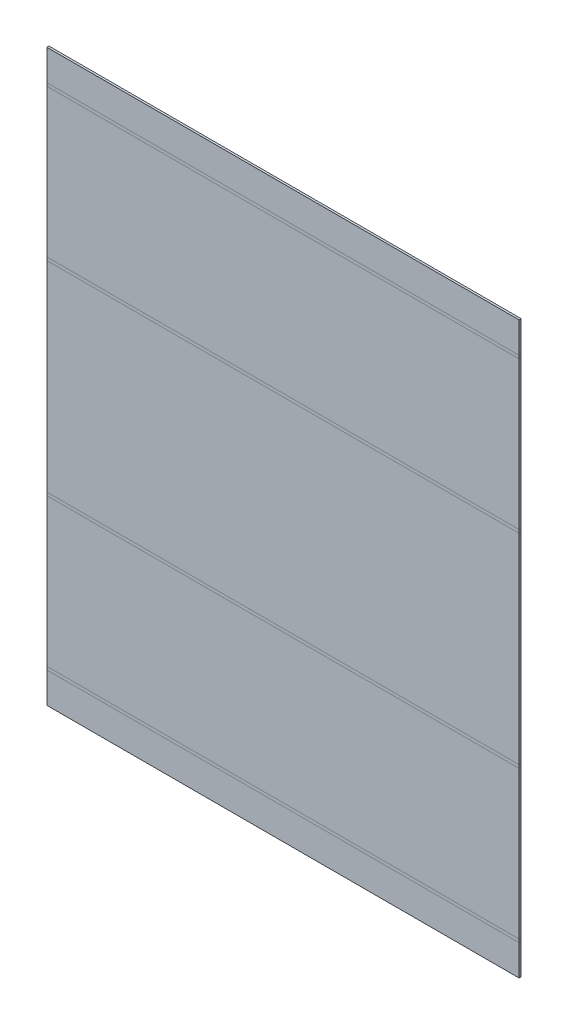
ISO-10303-21;
HEADER;
FILE_DESCRIPTION(('STEP AP214'),'2;1');
FILE_NAME('part.step','',(''),(''),'','','');
FILE_SCHEMA(('AUTOMOTIVE_DESIGN { 1 0 10303 214 1 1 1 1 }'));
ENDSEC;
DATA;
#1=APPLICATION_CONTEXT('core data for automotive mechanical design processes');
#2=APPLICATION_PROTOCOL_DEFINITION('international standard','automotive_design',2000,#1);
#3=PRODUCT_CONTEXT('',#1,'mechanical');
#4=PRODUCT('Part','Part','',(#3));
#5=PRODUCT_RELATED_PRODUCT_CATEGORY('part','',(#4));
#6=PRODUCT_DEFINITION_FORMATION('','',#4);
#7=PRODUCT_DEFINITION_CONTEXT('part definition',#1,'design');
#8=PRODUCT_DEFINITION('design','',#6,#7);
#9=PRODUCT_DEFINITION_SHAPE('','',#8);
#10=(LENGTH_UNIT() NAMED_UNIT(*) SI_UNIT(.MILLI.,.METRE.));
#11=(NAMED_UNIT(*) PLANE_ANGLE_UNIT() SI_UNIT($,.RADIAN.));
#12=(NAMED_UNIT(*) SI_UNIT($,.STERADIAN.) SOLID_ANGLE_UNIT());
#13=UNCERTAINTY_MEASURE_WITH_UNIT(LENGTH_MEASURE(1.E-05),#10,'distance_accuracy_value','');
#14=(GEOMETRIC_REPRESENTATION_CONTEXT(3) GLOBAL_UNCERTAINTY_ASSIGNED_CONTEXT((#13)) GLOBAL_UNIT_ASSIGNED_CONTEXT((#10,
#11,#12)) REPRESENTATION_CONTEXT('',''));
#15=CARTESIAN_POINT('',(0.,0.,0.));
#16=DIRECTION('',(0.,0.,1.));
#17=DIRECTION('',(1.,0.,0.));
#18=AXIS2_PLACEMENT_3D('',#15,#16,#17);
#19=CARTESIAN_POINT('',(355.6,0.,-1.5875));
#20=DIRECTION('',(0.,0.,1.));
#21=DIRECTION('',(1.,0.,0.));
#22=AXIS2_PLACEMENT_3D('',#19,#20,#21);
#23=PLANE('',#22);
#24=DIRECTION('',(-1.,0.,0.));
#25=VECTOR('',#24,1.);
#26=CARTESIAN_POINT('',(355.6,0.736599999999969,-1.58749999999999));
#27=LINE('',#26,#25);
#28=CARTESIAN_POINT('',(355.6,0.736599999999969,-1.58749999999999));
#29=VERTEX_POINT('',#28);
#30=CARTESIAN_POINT('',(0.,0.736599999999971,-1.58749999999999));
#31=VERTEX_POINT('',#30);
#32=EDGE_CURVE('E356',#29,#31,#27,.T.);
#33=ORIENTED_EDGE('',*,*,#32,.T.);
#34=DIRECTION('',(0.,1.,0.));
#35=VECTOR('',#34,1.);
#36=CARTESIAN_POINT('',(0.,0.,-1.5875));
#37=LINE('',#36,#35);
#38=CARTESIAN_POINT('',(0.,151.6634,-1.5875));
#39=VERTEX_POINT('',#38);
#40=EDGE_CURVE('E337',#31,#39,#37,.T.);
#41=ORIENTED_EDGE('',*,*,#40,.T.);
#42=DIRECTION('',(1.,0.,0.));
#43=VECTOR('',#42,1.);
#44=CARTESIAN_POINT('',(0.,151.6634,-1.5875));
#45=LINE('',#44,#43);
#46=CARTESIAN_POINT('',(355.6,151.6634,-1.5875));
#47=VERTEX_POINT('',#46);
#48=EDGE_CURVE('E48',#39,#47,#45,.T.);
#49=ORIENTED_EDGE('',*,*,#48,.T.);
#50=DIRECTION('',(0.,1.,0.));
#51=VECTOR('',#50,1.);
#52=CARTESIAN_POINT('',(355.6,0.,-1.5875));
#53=LINE('',#52,#51);
#54=EDGE_CURVE('E341',#29,#47,#53,.T.);
#55=ORIENTED_EDGE('',*,*,#54,.F.);
#56=EDGE_LOOP('',(#33,#41,#49,#55));
#57=FACE_BOUND('',#56,.T.);
#58=ADVANCED_FACE('F41',(#57),#23,.F.);
#59=CARTESIAN_POINT('',(355.6,0.,0.));
#60=DIRECTION('',(0.,0.,1.));
#61=DIRECTION('',(1.,0.,0.));
#62=AXIS2_PLACEMENT_3D('',#59,#60,#61);
#63=PLANE('',#62);
#64=DIRECTION('',(0.,1.,0.));
#65=VECTOR('',#64,1.);
#66=CARTESIAN_POINT('',(0.,0.,0.));
#67=LINE('',#66,#65);
#68=CARTESIAN_POINT('',(0.,0.736599999999971,0.));
#69=VERTEX_POINT('',#68);
#70=CARTESIAN_POINT('',(0.,151.6634,0.));
#71=VERTEX_POINT('',#70);
#72=EDGE_CURVE('E345',#69,#71,#67,.T.);
#73=ORIENTED_EDGE('',*,*,#72,.F.);
#74=DIRECTION('',(-1.,0.,0.));
#75=VECTOR('',#74,1.);
#76=CARTESIAN_POINT('',(355.6,0.736599999999997,0.));
#77=LINE('',#76,#75);
#78=CARTESIAN_POINT('',(355.6,0.736599999999997,0.));
#79=VERTEX_POINT('',#78);
#80=EDGE_CURVE('E348',#79,#69,#77,.T.);
#81=ORIENTED_EDGE('',*,*,#80,.F.);
#82=DIRECTION('',(0.,1.,0.));
#83=VECTOR('',#82,1.);
#84=CARTESIAN_POINT('',(355.6,0.,0.));
#85=LINE('',#84,#83);
#86=CARTESIAN_POINT('',(355.6,151.6634,0.));
#87=VERTEX_POINT('',#86);
#88=EDGE_CURVE('E344',#79,#87,#85,.T.);
#89=ORIENTED_EDGE('',*,*,#88,.T.);
#90=DIRECTION('',(1.,0.,0.));
#91=VECTOR('',#90,1.);
#92=CARTESIAN_POINT('',(0.,151.6634,0.));
#93=LINE('',#92,#91);
#94=EDGE_CURVE('E374',#71,#87,#93,.T.);
#95=ORIENTED_EDGE('',*,*,#94,.F.);
#96=EDGE_LOOP('',(#73,#81,#89,#95));
#97=FACE_BOUND('',#96,.T.);
#98=ADVANCED_FACE('F403',(#97),#63,.T.);
#99=CARTESIAN_POINT('',(355.6,0.,0.));
#100=DIRECTION('',(-1.,0.,0.));
#101=DIRECTION('',(0.,0.,1.));
#102=AXIS2_PLACEMENT_3D('',#99,#100,#101);
#103=PLANE('',#102);
#104=DIRECTION('',(0.,0.,-1.));
#105=VECTOR('',#104,1.);
#106=CARTESIAN_POINT('',(355.6,0.736599999999997,0.));
#107=LINE('',#106,#105);
#108=EDGE_CURVE('E359',#79,#29,#107,.T.);
#109=ORIENTED_EDGE('',*,*,#108,.T.);
#110=ORIENTED_EDGE('',*,*,#54,.T.);
#111=DIRECTION('',(0.,0.,-1.));
#112=VECTOR('',#111,1.);
#113=CARTESIAN_POINT('',(355.6,151.6634,0.));
#114=LINE('',#113,#112);
#115=EDGE_CURVE('E376',#87,#47,#114,.T.);
#116=ORIENTED_EDGE('',*,*,#115,.F.);
#117=ORIENTED_EDGE('',*,*,#88,.F.);
#118=EDGE_LOOP('',(#109,#110,#116,#117));
#119=FACE_BOUND('',#118,.T.);
#120=ADVANCED_FACE('F389',(#119),#103,.F.);
#121=CARTESIAN_POINT('',(0.,0.,0.));
#122=DIRECTION('',(-1.,0.,0.));
#123=DIRECTION('',(0.,0.,1.));
#124=AXIS2_PLACEMENT_3D('',#121,#122,#123);
#125=PLANE('',#124);
#126=DIRECTION('',(0.,0.,-1.));
#127=VECTOR('',#126,1.);
#128=CARTESIAN_POINT('',(0.,0.736599999999971,0.));
#129=LINE('',#128,#127);
#130=EDGE_CURVE('E354',#69,#31,#129,.T.);
#131=ORIENTED_EDGE('',*,*,#130,.F.);
#132=ORIENTED_EDGE('',*,*,#72,.T.);
#133=DIRECTION('',(0.,0.,-1.));
#134=VECTOR('',#133,1.);
#135=CARTESIAN_POINT('',(0.,151.6634,0.));
#136=LINE('',#135,#134);
#137=EDGE_CURVE('E11',#71,#39,#136,.T.);
#138=ORIENTED_EDGE('',*,*,#137,.T.);
#139=ORIENTED_EDGE('',*,*,#40,.F.);
#140=EDGE_LOOP('',(#131,#132,#138,#139));
#141=FACE_BOUND('',#140,.T.);
#142=ADVANCED_FACE('F407',(#141),#125,.T.);
#143=CARTESIAN_POINT('',(0.,0.736599999999971,0.));
#144=DIRECTION('',(-1.,0.,0.));
#145=DIRECTION('',(0.,-1.,0.));
#146=AXIS2_PLACEMENT_3D('',#143,#144,#145);
#147=PLANE('',#146);
#148=ORIENTED_EDGE('',*,*,#130,.T.);
#149=DIRECTION('',(0.,1.,0.));
#150=VECTOR('',#149,1.);
#151=CARTESIAN_POINT('',(0.,-0.465334079355303,-1.58749999999999));
#152=LINE('',#151,#150);
#153=CARTESIAN_POINT('',(0.,-1.66726815871059,-1.5875));
#154=VERTEX_POINT('',#153);
#155=EDGE_CURVE('E313',#31,#154,#152,.F.);
#156=ORIENTED_EDGE('',*,*,#155,.T.);
#157=DIRECTION('',(0.,0.,-1.));
#158=VECTOR('',#157,1.);
#159=CARTESIAN_POINT('',(0.,-1.6672681587106,0.));
#160=LINE('',#159,#158);
#161=CARTESIAN_POINT('',(0.,-1.6672681587106,0.));
#162=VERTEX_POINT('',#161);
#163=EDGE_CURVE('E317',#162,#154,#160,.T.);
#164=ORIENTED_EDGE('',*,*,#163,.F.);
#165=DIRECTION('',(0.,-1.,0.));
#166=VECTOR('',#165,1.);
#167=CARTESIAN_POINT('',(0.,0.736599999999971,0.));
#168=LINE('',#167,#166);
#169=EDGE_CURVE('E330',#69,#162,#168,.T.);
#170=ORIENTED_EDGE('',*,*,#169,.F.);
#171=EDGE_LOOP('',(#148,#156,#164,#170));
#172=FACE_BOUND('',#171,.T.);
#173=ADVANCED_FACE('F410',(#172),#147,.T.);
#174=CARTESIAN_POINT('',(355.6,-1.6672681587106,0.));
#175=DIRECTION('',(1.,0.,0.));
#176=DIRECTION('',(0.,1.,0.));
#177=AXIS2_PLACEMENT_3D('',#174,#175,#176);
#178=PLANE('',#177);
#179=DIRECTION('',(0.,1.,0.));
#180=VECTOR('',#179,1.);
#181=CARTESIAN_POINT('',(355.6,-0.465334079355303,-1.58749999999999));
#182=LINE('',#181,#180);
#183=CARTESIAN_POINT('',(355.6,-1.66726815871057,-1.58750000000003));
#184=VERTEX_POINT('',#183);
#185=EDGE_CURVE('E334',#184,#29,#182,.T.);
#186=ORIENTED_EDGE('',*,*,#185,.T.);
#187=ORIENTED_EDGE('',*,*,#108,.F.);
#188=DIRECTION('',(0.,1.,0.));
#189=VECTOR('',#188,1.);
#190=CARTESIAN_POINT('',(355.6,-1.6672681587106,0.));
#191=LINE('',#190,#189);
#192=CARTESIAN_POINT('',(355.6,-1.6672681587106,0.));
#193=VERTEX_POINT('',#192);
#194=EDGE_CURVE('E333',#193,#79,#191,.T.);
#195=ORIENTED_EDGE('',*,*,#194,.F.);
#196=DIRECTION('',(0.,0.,-1.));
#197=VECTOR('',#196,1.);
#198=CARTESIAN_POINT('',(355.6,-1.66726815871058,0.));
#199=LINE('',#198,#197);
#200=EDGE_CURVE('E325',#193,#184,#199,.T.);
#201=ORIENTED_EDGE('',*,*,#200,.T.);
#202=EDGE_LOOP('',(#186,#187,#195,#201));
#203=FACE_BOUND('',#202,.T.);
#204=ADVANCED_FACE('F393',(#203),#178,.T.);
#205=CARTESIAN_POINT('',(177.8,-0.465334079355303,0.));
#206=DIRECTION('',(0.,0.,1.));
#207=DIRECTION('',(1.,0.,0.));
#208=AXIS2_PLACEMENT_3D('',#205,#206,#207);
#209=PLANE('',#208);
#210=DIRECTION('',(1.,0.,0.));
#211=VECTOR('',#210,1.);
#212=CARTESIAN_POINT('',(0.,-1.6672681587106,0.));
#213=LINE('',#212,#211);
#214=EDGE_CURVE('E306',#162,#193,#213,.T.);
#215=ORIENTED_EDGE('',*,*,#214,.T.);
#216=ORIENTED_EDGE('',*,*,#194,.T.);
#217=ORIENTED_EDGE('',*,*,#80,.T.);
#218=ORIENTED_EDGE('',*,*,#169,.T.);
#219=EDGE_LOOP('',(#215,#216,#217,#218));
#220=FACE_BOUND('',#219,.T.);
#221=ADVANCED_FACE('F398',(#220),#209,.T.);
#222=CARTESIAN_POINT('',(177.8,-0.465334079355303,-1.58749999999999));
#223=DIRECTION('',(0.,0.,1.));
#224=DIRECTION('',(1.,0.,0.));
#225=AXIS2_PLACEMENT_3D('',#222,#223,#224);
#226=PLANE('',#225);
#227=DIRECTION('',(-1.,0.,0.));
#228=VECTOR('',#227,1.);
#229=CARTESIAN_POINT('',(0.,-1.66726815871059,-1.5875));
#230=LINE('',#229,#228);
#231=EDGE_CURVE('E322',#184,#154,#230,.T.);
#232=ORIENTED_EDGE('',*,*,#231,.T.);
#233=ORIENTED_EDGE('',*,*,#155,.F.);
#234=ORIENTED_EDGE('',*,*,#32,.F.);
#235=ORIENTED_EDGE('',*,*,#185,.F.);
#236=EDGE_LOOP('',(#232,#233,#234,#235));
#237=FACE_BOUND('',#236,.T.);
#238=ADVANCED_FACE('F413',(#237),#226,.F.);
#239=CARTESIAN_POINT('',(0.,-0.930668158710607,0.));
#240=DIRECTION('',(0.,0.,1.));
#241=DIRECTION('',(0.,-1.,0.));
#242=AXIS2_PLACEMENT_3D('',#239,#240,#241);
#243=PLANE('',#242);
#244=DIRECTION('',(0.,1.,0.));
#245=VECTOR('',#244,1.);
#246=CARTESIAN_POINT('',(0.,-0.930668158710607,0.));
#247=LINE('',#246,#245);
#248=CARTESIAN_POINT('',(0.,-112.906568158711,-7.80003764797737E-13));
#249=VERTEX_POINT('',#248);
#250=EDGE_CURVE('E320',#249,#162,#247,.T.);
#251=ORIENTED_EDGE('',*,*,#250,.F.);
#252=DIRECTION('',(1.,0.,0.));
#253=VECTOR('',#252,1.);
#254=CARTESIAN_POINT('',(0.,-112.906568158711,-7.80003764797737E-13));
#255=LINE('',#254,#253);
#256=CARTESIAN_POINT('',(355.6,-112.906568158711,-8.06174162064628E-13));
#257=VERTEX_POINT('',#256);
#258=EDGE_CURVE('E362',#249,#257,#255,.T.);
#259=ORIENTED_EDGE('',*,*,#258,.T.);
#260=DIRECTION('',(0.,-1.,0.));
#261=VECTOR('',#260,1.);
#262=CARTESIAN_POINT('',(355.6,-113.643168158711,-8.08063667707448E-13));
#263=LINE('',#262,#261);
#264=EDGE_CURVE('E311',#193,#257,#263,.T.);
#265=ORIENTED_EDGE('',*,*,#264,.F.);
#266=ORIENTED_EDGE('',*,*,#214,.F.);
#267=EDGE_LOOP('',(#251,#259,#265,#266));
#268=FACE_BOUND('',#267,.T.);
#269=ADVANCED_FACE('F419',(#268),#243,.T.);
#270=CARTESIAN_POINT('',(0.,-0.930668158710596,-1.58749999999999));
#271=DIRECTION('',(1.,0.,0.));
#272=DIRECTION('',(0.,1.,0.));
#273=AXIS2_PLACEMENT_3D('',#270,#271,#272);
#274=PLANE('',#273);
#275=DIRECTION('',(0.,0.,1.));
#276=VECTOR('',#275,1.);
#277=CARTESIAN_POINT('',(0.,-112.906568158711,-1.58750000000078));
#278=LINE('',#277,#276);
#279=CARTESIAN_POINT('',(0.,-112.906568158711,-1.58750000000078));
#280=VERTEX_POINT('',#279);
#281=EDGE_CURVE('E365',#280,#249,#278,.T.);
#282=ORIENTED_EDGE('',*,*,#281,.T.);
#283=ORIENTED_EDGE('',*,*,#250,.T.);
#284=ORIENTED_EDGE('',*,*,#163,.T.);
#285=DIRECTION('',(0.,1.,0.));
#286=VECTOR('',#285,1.);
#287=CARTESIAN_POINT('',(0.,-0.930668158710596,-1.58749999999999));
#288=LINE('',#287,#286);
#289=EDGE_CURVE('E315',#280,#154,#288,.T.);
#290=ORIENTED_EDGE('',*,*,#289,.F.);
#291=EDGE_LOOP('',(#282,#283,#284,#290));
#292=FACE_BOUND('',#291,.T.);
#293=ADVANCED_FACE('F487',(#292),#274,.F.);
#294=CARTESIAN_POINT('',(0.,-0.930668158710596,-1.58749999999999));
#295=DIRECTION('',(0.,0.,1.));
#296=DIRECTION('',(0.,-1.,0.));
#297=AXIS2_PLACEMENT_3D('',#294,#295,#296);
#298=PLANE('',#297);
#299=DIRECTION('',(1.,0.,0.));
#300=VECTOR('',#299,1.);
#301=CARTESIAN_POINT('',(0.,-112.906568158711,-1.58750000000078));
#302=LINE('',#301,#300);
#303=CARTESIAN_POINT('',(355.6,-112.906568158711,-1.58750000000081));
#304=VERTEX_POINT('',#303);
#305=EDGE_CURVE('E368',#280,#304,#302,.T.);
#306=ORIENTED_EDGE('',*,*,#305,.F.);
#307=ORIENTED_EDGE('',*,*,#289,.T.);
#308=ORIENTED_EDGE('',*,*,#231,.F.);
#309=DIRECTION('',(0.,-1.,0.));
#310=VECTOR('',#309,1.);
#311=CARTESIAN_POINT('',(355.6,-113.643168158711,-1.58750000000081));
#312=LINE('',#311,#310);
#313=EDGE_CURVE('E63',#184,#304,#312,.T.);
#314=ORIENTED_EDGE('',*,*,#313,.T.);
#315=EDGE_LOOP('',(#306,#307,#308,#314));
#316=FACE_BOUND('',#315,.T.);
#317=ADVANCED_FACE('F414',(#316),#298,.F.);
#318=CARTESIAN_POINT('',(355.6,-113.643168158711,-1.58750000000081));
#319=DIRECTION('',(-1.,0.,0.));
#320=DIRECTION('',(0.,-1.,0.));
#321=AXIS2_PLACEMENT_3D('',#318,#319,#320);
#322=PLANE('',#321);
#323=DIRECTION('',(0.,0.,1.));
#324=VECTOR('',#323,1.);
#325=CARTESIAN_POINT('',(355.6,-112.906568158711,-1.58750000000081));
#326=LINE('',#325,#324);
#327=EDGE_CURVE('E371',#304,#257,#326,.T.);
#328=ORIENTED_EDGE('',*,*,#327,.F.);
#329=ORIENTED_EDGE('',*,*,#313,.F.);
#330=ORIENTED_EDGE('',*,*,#200,.F.);
#331=ORIENTED_EDGE('',*,*,#264,.T.);
#332=EDGE_LOOP('',(#328,#329,#330,#331));
#333=FACE_BOUND('',#332,.T.);
#334=ADVANCED_FACE('F417',(#333),#322,.F.);
#335=CARTESIAN_POINT('',(0.,-115.310436317421,-7.96789886432091E-13));
#336=DIRECTION('',(-1.,0.,0.));
#337=DIRECTION('',(0.,-1.,0.));
#338=AXIS2_PLACEMENT_3D('',#335,#336,#337);
#339=PLANE('',#338);
#340=ORIENTED_EDGE('',*,*,#281,.F.);
#341=DIRECTION('',(0.,-1.,0.));
#342=VECTOR('',#341,1.);
#343=CARTESIAN_POINT('',(0.,-114.108502238066,-1.58750000000079));
#344=LINE('',#343,#342);
#345=CARTESIAN_POINT('',(0.,-115.310436317421,-1.5875000000008));
#346=VERTEX_POINT('',#345);
#347=EDGE_CURVE('E271',#280,#346,#344,.T.);
#348=ORIENTED_EDGE('',*,*,#347,.T.);
#349=DIRECTION('',(0.,0.,1.));
#350=VECTOR('',#349,1.);
#351=CARTESIAN_POINT('',(0.,-115.310436317421,-1.5875000000008));
#352=LINE('',#351,#350);
#353=CARTESIAN_POINT('',(0.,-115.310436317421,-7.91033905045424E-13));
#354=VERTEX_POINT('',#353);
#355=EDGE_CURVE('E291',#346,#354,#352,.T.);
#356=ORIENTED_EDGE('',*,*,#355,.T.);
#357=DIRECTION('',(0.,-1.,0.));
#358=VECTOR('',#357,1.);
#359=CARTESIAN_POINT('',(0.,-115.310436317421,-7.96789886432091E-13));
#360=LINE('',#359,#358);
#361=EDGE_CURVE('E299',#249,#354,#360,.T.);
#362=ORIENTED_EDGE('',*,*,#361,.F.);
#363=EDGE_LOOP('',(#340,#348,#356,#362));
#364=FACE_BOUND('',#363,.T.);
#365=ADVANCED_FACE('F440',(#364),#339,.T.);
#366=CARTESIAN_POINT('',(355.6,-112.906568158711,-8.06174162064628E-13));
#367=DIRECTION('',(1.,0.,0.));
#368=DIRECTION('',(0.,1.,0.));
#369=AXIS2_PLACEMENT_3D('',#366,#367,#368);
#370=PLANE('',#369);
#371=DIRECTION('',(0.,-1.,0.));
#372=VECTOR('',#371,1.);
#373=CARTESIAN_POINT('',(355.6,-114.108502238066,-1.58750000000081));
#374=LINE('',#373,#372);
#375=CARTESIAN_POINT('',(355.6,-115.310436317421,-1.58750000000081));
#376=VERTEX_POINT('',#375);
#377=EDGE_CURVE('E303',#376,#304,#374,.F.);
#378=ORIENTED_EDGE('',*,*,#377,.T.);
#379=ORIENTED_EDGE('',*,*,#327,.T.);
#380=DIRECTION('',(0.,1.,0.));
#381=VECTOR('',#380,1.);
#382=CARTESIAN_POINT('',(355.6,-112.906568158711,-8.06174162064628E-13));
#383=LINE('',#382,#381);
#384=CARTESIAN_POINT('',(355.6,-115.310436317421,-8.22960283698983E-13));
#385=VERTEX_POINT('',#384);
#386=EDGE_CURVE('E302',#385,#257,#383,.T.);
#387=ORIENTED_EDGE('',*,*,#386,.F.);
#388=DIRECTION('',(0.,0.,1.));
#389=VECTOR('',#388,1.);
#390=CARTESIAN_POINT('',(355.6,-115.310436317421,-1.58750000000081));
#391=LINE('',#390,#389);
#392=EDGE_CURVE('E275',#376,#385,#391,.T.);
#393=ORIENTED_EDGE('',*,*,#392,.F.);
#394=EDGE_LOOP('',(#378,#379,#387,#393));
#395=FACE_BOUND('',#394,.T.);
#396=ADVANCED_FACE('F425',(#395),#370,.T.);
#397=CARTESIAN_POINT('',(177.8,-114.108502238066,-8.0148202424836E-13));
#398=DIRECTION('',(0.,0.,1.));
#399=DIRECTION('',(0.,-1.,0.));
#400=AXIS2_PLACEMENT_3D('',#397,#398,#399);
#401=PLANE('',#400);
#402=DIRECTION('',(1.,0.,0.));
#403=VECTOR('',#402,1.);
#404=CARTESIAN_POINT('',(0.,-115.310436317421,-7.91033905045424E-13));
#405=LINE('',#404,#403);
#406=EDGE_CURVE('E265',#354,#385,#405,.T.);
#407=ORIENTED_EDGE('',*,*,#406,.T.);
#408=ORIENTED_EDGE('',*,*,#386,.T.);
#409=ORIENTED_EDGE('',*,*,#258,.F.);
#410=ORIENTED_EDGE('',*,*,#361,.T.);
#411=EDGE_LOOP('',(#407,#408,#409,#410));
#412=FACE_BOUND('',#411,.T.);
#413=ADVANCED_FACE('F428',(#412),#401,.T.);
#414=CARTESIAN_POINT('',(177.8,-114.108502238066,-1.5875000000008));
#415=DIRECTION('',(0.,0.,1.));
#416=DIRECTION('',(0.,-1.,0.));
#417=AXIS2_PLACEMENT_3D('',#414,#415,#416);
#418=PLANE('',#417);
#419=DIRECTION('',(-1.,0.,0.));
#420=VECTOR('',#419,1.);
#421=CARTESIAN_POINT('',(355.6,-115.310436317421,-1.58750000000081));
#422=LINE('',#421,#420);
#423=EDGE_CURVE('E294',#376,#346,#422,.T.);
#424=ORIENTED_EDGE('',*,*,#423,.T.);
#425=ORIENTED_EDGE('',*,*,#347,.F.);
#426=ORIENTED_EDGE('',*,*,#305,.T.);
#427=ORIENTED_EDGE('',*,*,#377,.F.);
#428=EDGE_LOOP('',(#424,#425,#426,#427));
#429=FACE_BOUND('',#428,.T.);
#430=ADVANCED_FACE('F443',(#429),#418,.F.);
#431=CARTESIAN_POINT('',(355.6,-138.386336317421,-8.18789480661053E-13));
#432=DIRECTION('',(0.,1.,0.));
#433=DIRECTION('',(0.,0.,1.));
#434=AXIS2_PLACEMENT_3D('',#431,#432,#433);
#435=PLANE('',#434);
#436=DIRECTION('',(1.,0.,0.));
#437=VECTOR('',#436,1.);
#438=CARTESIAN_POINT('',(355.6,-138.386336317421,-1.58750000000082));
#439=LINE('',#438,#437);
#440=CARTESIAN_POINT('',(0.,-138.386336317421,-1.5875000000008));
#441=VERTEX_POINT('',#440);
#442=CARTESIAN_POINT('',(355.6,-138.386336317421,-1.58750000000082));
#443=VERTEX_POINT('',#442);
#444=EDGE_CURVE('E289',#441,#443,#439,.T.);
#445=ORIENTED_EDGE('',*,*,#444,.T.);
#446=DIRECTION('',(0.,0.,-1.));
#447=VECTOR('',#446,1.);
#448=CARTESIAN_POINT('',(355.6,-138.386336317421,-8.18789480661053E-13));
#449=LINE('',#448,#447);
#450=CARTESIAN_POINT('',(355.6,-138.386336317421,-8.18789480661053E-13));
#451=VERTEX_POINT('',#450);
#452=EDGE_CURVE('E272',#451,#443,#449,.T.);
#453=ORIENTED_EDGE('',*,*,#452,.F.);
#454=DIRECTION('',(1.,0.,0.));
#455=VECTOR('',#454,1.);
#456=CARTESIAN_POINT('',(355.6,-138.386336317421,-8.18789480661053E-13));
#457=LINE('',#456,#455);
#458=CARTESIAN_POINT('',(0.,-138.386336317421,-7.91033905045424E-13));
#459=VERTEX_POINT('',#458);
#460=EDGE_CURVE('E282',#459,#451,#457,.T.);
#461=ORIENTED_EDGE('',*,*,#460,.F.);
#462=DIRECTION('',(0.,0.,-1.));
#463=VECTOR('',#462,1.);
#464=CARTESIAN_POINT('',(0.,-138.386336317421,-7.91033905045424E-13));
#465=LINE('',#464,#463);
#466=EDGE_CURVE('E286',#459,#441,#465,.T.);
#467=ORIENTED_EDGE('',*,*,#466,.T.);
#468=EDGE_LOOP('',(#445,#453,#461,#467));
#469=FACE_BOUND('',#468,.T.);
#470=ADVANCED_FACE('F453',(#469),#435,.F.);
#471=CARTESIAN_POINT('',(0.,-112.986336317421,-7.91033905045424E-13));
#472=DIRECTION('',(0.,0.,-1.));
#473=DIRECTION('',(-1.,0.,0.));
#474=AXIS2_PLACEMENT_3D('',#471,#472,#473);
#475=PLANE('',#474);
#476=ORIENTED_EDGE('',*,*,#406,.F.);
#477=DIRECTION('',(0.,-1.,0.));
#478=VECTOR('',#477,1.);
#479=CARTESIAN_POINT('',(0.,-138.386336317421,-7.91033905045424E-13));
#480=LINE('',#479,#478);
#481=EDGE_CURVE('E284',#354,#459,#480,.T.);
#482=ORIENTED_EDGE('',*,*,#481,.T.);
#483=ORIENTED_EDGE('',*,*,#460,.T.);
#484=DIRECTION('',(0.,1.,0.));
#485=VECTOR('',#484,1.);
#486=CARTESIAN_POINT('',(355.6,-114.573836317421,-8.18789480661053E-13));
#487=LINE('',#486,#485);
#488=EDGE_CURVE('E279',#451,#385,#487,.T.);
#489=ORIENTED_EDGE('',*,*,#488,.T.);
#490=EDGE_LOOP('',(#476,#482,#483,#489));
#491=FACE_BOUND('',#490,.T.);
#492=ADVANCED_FACE('F431',(#491),#475,.F.);
#493=CARTESIAN_POINT('',(0.,-138.386336317421,-7.91033905045424E-13));
#494=DIRECTION('',(1.,0.,0.));
#495=DIRECTION('',(0.,0.,-1.));
#496=AXIS2_PLACEMENT_3D('',#493,#494,#495);
#497=PLANE('',#496);
#498=ORIENTED_EDGE('',*,*,#355,.F.);
#499=DIRECTION('',(0.,-1.,0.));
#500=VECTOR('',#499,1.);
#501=CARTESIAN_POINT('',(0.,-138.386336317421,-1.5875000000008));
#502=LINE('',#501,#500);
#503=EDGE_CURVE('E277',#346,#441,#502,.T.);
#504=ORIENTED_EDGE('',*,*,#503,.T.);
#505=ORIENTED_EDGE('',*,*,#466,.F.);
#506=ORIENTED_EDGE('',*,*,#481,.F.);
#507=EDGE_LOOP('',(#498,#504,#505,#506));
#508=FACE_BOUND('',#507,.T.);
#509=ADVANCED_FACE('F436',(#508),#497,.F.);
#510=CARTESIAN_POINT('',(0.,-112.986336317421,-1.5875000000008));
#511=DIRECTION('',(0.,0.,-1.));
#512=DIRECTION('',(-1.,0.,0.));
#513=AXIS2_PLACEMENT_3D('',#510,#511,#512);
#514=PLANE('',#513);
#515=ORIENTED_EDGE('',*,*,#503,.F.);
#516=ORIENTED_EDGE('',*,*,#423,.F.);
#517=DIRECTION('',(0.,1.,0.));
#518=VECTOR('',#517,1.);
#519=CARTESIAN_POINT('',(355.6,-114.573836317421,-1.58750000000082));
#520=LINE('',#519,#518);
#521=EDGE_CURVE('E269',#443,#376,#520,.T.);
#522=ORIENTED_EDGE('',*,*,#521,.F.);
#523=ORIENTED_EDGE('',*,*,#444,.F.);
#524=EDGE_LOOP('',(#515,#516,#522,#523));
#525=FACE_BOUND('',#524,.T.);
#526=ADVANCED_FACE('F447',(#525),#514,.T.);
#527=CARTESIAN_POINT('',(355.6,-114.573836317421,-8.18789480661053E-13));
#528=DIRECTION('',(-1.,0.,0.));
#529=DIRECTION('',(0.,0.,1.));
#530=AXIS2_PLACEMENT_3D('',#527,#528,#529);
#531=PLANE('',#530);
#532=ORIENTED_EDGE('',*,*,#392,.T.);
#533=ORIENTED_EDGE('',*,*,#488,.F.);
#534=ORIENTED_EDGE('',*,*,#452,.T.);
#535=ORIENTED_EDGE('',*,*,#521,.T.);
#536=EDGE_LOOP('',(#532,#533,#534,#535));
#537=FACE_BOUND('',#536,.T.);
#538=ADVANCED_FACE('F450',(#537),#531,.F.);
#539=CARTESIAN_POINT('',(355.6,151.6634,0.));
#540=DIRECTION('',(1.,0.,0.));
#541=DIRECTION('',(0.,1.,0.));
#542=AXIS2_PLACEMENT_3D('',#539,#540,#541);
#543=PLANE('',#542);
#544=ORIENTED_EDGE('',*,*,#115,.T.);
#545=DIRECTION('',(0.,1.,0.));
#546=VECTOR('',#545,1.);
#547=CARTESIAN_POINT('',(355.6,152.865334079355,-1.5875));
#548=LINE('',#547,#546);
#549=CARTESIAN_POINT('',(355.6,154.067268158711,-1.58749999999999));
#550=VERTEX_POINT('',#549);
#551=EDGE_CURVE('E189',#47,#550,#548,.T.);
#552=ORIENTED_EDGE('',*,*,#551,.T.);
#553=DIRECTION('',(0.,0.,-1.));
#554=VECTOR('',#553,1.);
#555=CARTESIAN_POINT('',(355.6,154.067268158711,0.));
#556=LINE('',#555,#554);
#557=CARTESIAN_POINT('',(355.6,154.067268158711,0.));
#558=VERTEX_POINT('',#557);
#559=EDGE_CURVE('E871',#558,#550,#556,.T.);
#560=ORIENTED_EDGE('',*,*,#559,.F.);
#561=DIRECTION('',(0.,1.,0.));
#562=VECTOR('',#561,1.);
#563=CARTESIAN_POINT('',(355.6,151.6634,0.));
#564=LINE('',#563,#562);
#565=EDGE_CURVE('E259',#87,#558,#564,.T.);
#566=ORIENTED_EDGE('',*,*,#565,.F.);
#567=EDGE_LOOP('',(#544,#552,#560,#566));
#568=FACE_BOUND('',#567,.T.);
#569=ADVANCED_FACE('F501',(#568),#543,.T.);
#570=CARTESIAN_POINT('',(0.,154.067268158711,0.));
#571=DIRECTION('',(-1.,0.,0.));
#572=DIRECTION('',(0.,-1.,0.));
#573=AXIS2_PLACEMENT_3D('',#570,#571,#572);
#574=PLANE('',#573);
#575=DIRECTION('',(0.,1.,0.));
#576=VECTOR('',#575,1.);
#577=CARTESIAN_POINT('',(0.,152.865334079355,-1.5875));
#578=LINE('',#577,#576);
#579=CARTESIAN_POINT('',(0.,154.067268158711,-1.58749999999999));
#580=VERTEX_POINT('',#579);
#581=EDGE_CURVE('E55',#580,#39,#578,.F.);
#582=ORIENTED_EDGE('',*,*,#581,.T.);
#583=ORIENTED_EDGE('',*,*,#137,.F.);
#584=DIRECTION('',(0.,-1.,0.));
#585=VECTOR('',#584,1.);
#586=CARTESIAN_POINT('',(0.,154.067268158711,0.));
#587=LINE('',#586,#585);
#588=CARTESIAN_POINT('',(0.,154.067268158711,0.));
#589=VERTEX_POINT('',#588);
#590=EDGE_CURVE('E262',#589,#71,#587,.T.);
#591=ORIENTED_EDGE('',*,*,#590,.F.);
#592=DIRECTION('',(0.,0.,-1.));
#593=VECTOR('',#592,1.);
#594=CARTESIAN_POINT('',(0.,154.067268158711,0.));
#595=LINE('',#594,#593);
#596=EDGE_CURVE('E185',#589,#580,#595,.T.);
#597=ORIENTED_EDGE('',*,*,#596,.T.);
#598=EDGE_LOOP('',(#582,#583,#591,#597));
#599=FACE_BOUND('',#598,.T.);
#600=ADVANCED_FACE('F525',(#599),#574,.T.);
#601=CARTESIAN_POINT('',(177.8,152.865334079355,0.));
#602=DIRECTION('',(0.,0.,1.));
#603=DIRECTION('',(1.,0.,0.));
#604=AXIS2_PLACEMENT_3D('',#601,#602,#603);
#605=PLANE('',#604);
#606=DIRECTION('',(-1.,0.,0.));
#607=VECTOR('',#606,1.);
#608=CARTESIAN_POINT('',(355.6,154.067268158711,0.));
#609=LINE('',#608,#607);
#610=EDGE_CURVE('E257',#558,#589,#609,.T.);
#611=ORIENTED_EDGE('',*,*,#610,.T.);
#612=ORIENTED_EDGE('',*,*,#590,.T.);
#613=ORIENTED_EDGE('',*,*,#94,.T.);
#614=ORIENTED_EDGE('',*,*,#565,.T.);
#615=EDGE_LOOP('',(#611,#612,#613,#614));
#616=FACE_BOUND('',#615,.T.);
#617=ADVANCED_FACE('F535',(#616),#605,.T.);
#618=CARTESIAN_POINT('',(177.8,152.865334079355,-1.5875));
#619=DIRECTION('',(0.,0.,1.));
#620=DIRECTION('',(1.,0.,0.));
#621=AXIS2_PLACEMENT_3D('',#618,#619,#620);
#622=PLANE('',#621);
#623=DIRECTION('',(1.,0.,0.));
#624=VECTOR('',#623,1.);
#625=CARTESIAN_POINT('',(0.,154.067268158711,-1.58749999999999));
#626=LINE('',#625,#624);
#627=EDGE_CURVE('E253',#580,#550,#626,.T.);
#628=ORIENTED_EDGE('',*,*,#627,.T.);
#629=ORIENTED_EDGE('',*,*,#551,.F.);
#630=ORIENTED_EDGE('',*,*,#48,.F.);
#631=ORIENTED_EDGE('',*,*,#581,.F.);
#632=EDGE_LOOP('',(#628,#629,#630,#631));
#633=FACE_BOUND('',#632,.T.);
#634=ADVANCED_FACE('F383',(#633),#622,.F.);
#635=CARTESIAN_POINT('',(0.,290.786336317421,-7.7715611723761E-13));
#636=DIRECTION('',(0.,-1.,0.));
#637=DIRECTION('',(0.,0.,-1.));
#638=AXIS2_PLACEMENT_3D('',#635,#636,#637);
#639=PLANE('',#638);
#640=DIRECTION('',(-1.,0.,0.));
#641=VECTOR('',#640,1.);
#642=CARTESIAN_POINT('',(0.,290.786336317421,-1.58750000000077));
#643=LINE('',#642,#641);
#644=CARTESIAN_POINT('',(355.6,290.786336317421,-1.58750000000077));
#645=VERTEX_POINT('',#644);
#646=CARTESIAN_POINT('',(0.,290.786336317421,-1.58750000000077));
#647=VERTEX_POINT('',#646);
#648=EDGE_CURVE('E251',#645,#647,#643,.T.);
#649=ORIENTED_EDGE('',*,*,#648,.T.);
#650=DIRECTION('',(0.,0.,-1.));
#651=VECTOR('',#650,1.);
#652=CARTESIAN_POINT('',(0.,290.786336317421,-7.7715611723761E-13));
#653=LINE('',#652,#651);
#654=CARTESIAN_POINT('',(0.,290.786336317421,-7.7715611723761E-13));
#655=VERTEX_POINT('',#654);
#656=EDGE_CURVE('E243',#655,#647,#653,.T.);
#657=ORIENTED_EDGE('',*,*,#656,.F.);
#658=DIRECTION('',(-1.,0.,0.));
#659=VECTOR('',#658,1.);
#660=CARTESIAN_POINT('',(0.,290.786336317421,-7.7715611723761E-13));
#661=LINE('',#660,#659);
#662=CARTESIAN_POINT('',(355.6,290.786336317421,-7.7715611723761E-13));
#663=VERTEX_POINT('',#662);
#664=EDGE_CURVE('E235',#663,#655,#661,.T.);
#665=ORIENTED_EDGE('',*,*,#664,.F.);
#666=DIRECTION('',(0.,0.,-1.));
#667=VECTOR('',#666,1.);
#668=CARTESIAN_POINT('',(355.6,290.786336317421,-7.7715611723761E-13));
#669=LINE('',#668,#667);
#670=EDGE_CURVE('E248',#663,#645,#669,.T.);
#671=ORIENTED_EDGE('',*,*,#670,.T.);
#672=EDGE_LOOP('',(#649,#657,#665,#671));
#673=FACE_BOUND('',#672,.T.);
#674=ADVANCED_FACE('F552',(#673),#639,.F.);
#675=CARTESIAN_POINT('',(0.,266.973836317421,-7.49400541621981E-13));
#676=DIRECTION('',(1.,0.,0.));
#677=DIRECTION('',(0.,0.,-1.));
#678=AXIS2_PLACEMENT_3D('',#675,#676,#677);
#679=PLANE('',#678);
#680=DIRECTION('',(0.,0.,1.));
#681=VECTOR('',#680,1.);
#682=CARTESIAN_POINT('',(0.,267.710436317421,-1.58750000000077));
#683=LINE('',#682,#681);
#684=CARTESIAN_POINT('',(0.,267.710436317421,-1.58750000000077));
#685=VERTEX_POINT('',#684);
#686=CARTESIAN_POINT('',(0.,267.710436317421,-7.7715611723761E-13));
#687=VERTEX_POINT('',#686);
#688=EDGE_CURVE('E246',#685,#687,#683,.T.);
#689=ORIENTED_EDGE('',*,*,#688,.T.);
#690=DIRECTION('',(0.,-1.,0.));
#691=VECTOR('',#690,1.);
#692=CARTESIAN_POINT('',(0.,266.973836317421,-7.49400541621981E-13));
#693=LINE('',#692,#691);
#694=EDGE_CURVE('E232',#655,#687,#693,.T.);
#695=ORIENTED_EDGE('',*,*,#694,.F.);
#696=ORIENTED_EDGE('',*,*,#656,.T.);
#697=DIRECTION('',(0.,-1.,0.));
#698=VECTOR('',#697,1.);
#699=CARTESIAN_POINT('',(0.,266.973836317421,-1.58750000000077));
#700=LINE('',#699,#698);
#701=EDGE_CURVE('E241',#647,#685,#700,.T.);
#702=ORIENTED_EDGE('',*,*,#701,.T.);
#703=EDGE_LOOP('',(#689,#695,#696,#702));
#704=FACE_BOUND('',#703,.T.);
#705=ADVANCED_FACE('F561',(#704),#679,.F.);
#706=CARTESIAN_POINT('',(0.,112.986336317421,-1.5875000000008));
#707=DIRECTION('',(0.,0.,-1.));
#708=DIRECTION('',(-1.,0.,0.));
#709=AXIS2_PLACEMENT_3D('',#706,#707,#708);
#710=PLANE('',#709);
#711=DIRECTION('',(0.,1.,0.));
#712=VECTOR('',#711,1.);
#713=CARTESIAN_POINT('',(355.6,290.786336317421,-1.58750000000077));
#714=LINE('',#713,#712);
#715=CARTESIAN_POINT('',(355.6,267.710436317421,-1.58750000000077));
#716=VERTEX_POINT('',#715);
#717=EDGE_CURVE('E239',#716,#645,#714,.T.);
#718=ORIENTED_EDGE('',*,*,#717,.F.);
#719=DIRECTION('',(1.,0.,0.));
#720=VECTOR('',#719,1.);
#721=CARTESIAN_POINT('',(0.,267.710436317421,-1.58750000000077));
#722=LINE('',#721,#720);
#723=EDGE_CURVE('E212',#685,#716,#722,.T.);
#724=ORIENTED_EDGE('',*,*,#723,.F.);
#725=ORIENTED_EDGE('',*,*,#701,.F.);
#726=ORIENTED_EDGE('',*,*,#648,.F.);
#727=EDGE_LOOP('',(#718,#724,#725,#726));
#728=FACE_BOUND('',#727,.T.);
#729=ADVANCED_FACE('F569',(#728),#710,.T.);
#730=CARTESIAN_POINT('',(355.6,290.786336317421,-7.7715611723761E-13));
#731=DIRECTION('',(-1.,0.,0.));
#732=DIRECTION('',(0.,0.,1.));
#733=AXIS2_PLACEMENT_3D('',#730,#731,#732);
#734=PLANE('',#733);
#735=DIRECTION('',(0.,0.,1.));
#736=VECTOR('',#735,1.);
#737=CARTESIAN_POINT('',(355.6,267.710436317421,-1.58750000000077));
#738=LINE('',#737,#736);
#739=CARTESIAN_POINT('',(355.6,267.710436317421,-7.49400541621981E-13));
#740=VERTEX_POINT('',#739);
#741=EDGE_CURVE('E219',#716,#740,#738,.T.);
#742=ORIENTED_EDGE('',*,*,#741,.F.);
#743=ORIENTED_EDGE('',*,*,#717,.T.);
#744=ORIENTED_EDGE('',*,*,#670,.F.);
#745=DIRECTION('',(0.,1.,0.));
#746=VECTOR('',#745,1.);
#747=CARTESIAN_POINT('',(355.6,290.786336317421,-7.7715611723761E-13));
#748=LINE('',#747,#746);
#749=EDGE_CURVE('E237',#740,#663,#748,.T.);
#750=ORIENTED_EDGE('',*,*,#749,.F.);
#751=EDGE_LOOP('',(#742,#743,#744,#750));
#752=FACE_BOUND('',#751,.T.);
#753=ADVANCED_FACE('F577',(#752),#734,.F.);
#754=CARTESIAN_POINT('',(0.,112.986336317421,-7.7715611723761E-13));
#755=DIRECTION('',(0.,0.,-1.));
#756=DIRECTION('',(-1.,0.,0.));
#757=AXIS2_PLACEMENT_3D('',#754,#755,#756);
#758=PLANE('',#757);
#759=DIRECTION('',(-1.,0.,0.));
#760=VECTOR('',#759,1.);
#761=CARTESIAN_POINT('',(0.,267.710436317421,-7.49400541621981E-13));
#762=LINE('',#761,#760);
#763=EDGE_CURVE('E216',#740,#687,#762,.T.);
#764=ORIENTED_EDGE('',*,*,#763,.F.);
#765=ORIENTED_EDGE('',*,*,#749,.T.);
#766=ORIENTED_EDGE('',*,*,#664,.T.);
#767=ORIENTED_EDGE('',*,*,#694,.T.);
#768=EDGE_LOOP('',(#764,#765,#766,#767));
#769=FACE_BOUND('',#768,.T.);
#770=ADVANCED_FACE('F585',(#769),#758,.F.);
#771=CARTESIAN_POINT('',(0.,265.306568158711,-7.7715611723761E-13));
#772=DIRECTION('',(-1.,0.,0.));
#773=DIRECTION('',(0.,-1.,0.));
#774=AXIS2_PLACEMENT_3D('',#771,#772,#773);
#775=PLANE('',#774);
#776=DIRECTION('',(0.,-1.,0.));
#777=VECTOR('',#776,1.);
#778=CARTESIAN_POINT('',(0.,266.508502238066,-1.58750000000077));
#779=LINE('',#778,#777);
#780=CARTESIAN_POINT('',(0.,265.306568158711,-1.58750000000077));
#781=VERTEX_POINT('',#780);
#782=EDGE_CURVE('E211',#685,#781,#779,.T.);
#783=ORIENTED_EDGE('',*,*,#782,.T.);
#784=DIRECTION('',(0.,0.,1.));
#785=VECTOR('',#784,1.);
#786=CARTESIAN_POINT('',(0.,265.306568158711,-1.58750000000077));
#787=LINE('',#786,#785);
#788=CARTESIAN_POINT('',(0.,265.306568158711,-7.7715611723761E-13));
#789=VERTEX_POINT('',#788);
#790=EDGE_CURVE('E183',#781,#789,#787,.T.);
#791=ORIENTED_EDGE('',*,*,#790,.T.);
#792=DIRECTION('',(0.,-1.,0.));
#793=VECTOR('',#792,1.);
#794=CARTESIAN_POINT('',(0.,265.306568158711,-7.7715611723761E-13));
#795=LINE('',#794,#793);
#796=EDGE_CURVE('E209',#687,#789,#795,.T.);
#797=ORIENTED_EDGE('',*,*,#796,.F.);
#798=ORIENTED_EDGE('',*,*,#688,.F.);
#799=EDGE_LOOP('',(#783,#791,#797,#798));
#800=FACE_BOUND('',#799,.T.);
#801=ADVANCED_FACE('F207',(#800),#775,.T.);
#802=CARTESIAN_POINT('',(177.8,266.508502238066,-1.58750000000077));
#803=DIRECTION('',(0.,0.,1.));
#804=DIRECTION('',(0.,-1.,0.));
#805=AXIS2_PLACEMENT_3D('',#802,#803,#804);
#806=PLANE('',#805);
#807=ORIENTED_EDGE('',*,*,#723,.T.);
#808=DIRECTION('',(0.,-1.,0.));
#809=VECTOR('',#808,1.);
#810=CARTESIAN_POINT('',(355.6,266.508502238066,-1.58750000000077));
#811=LINE('',#810,#809);
#812=CARTESIAN_POINT('',(355.6,265.306568158711,-1.58750000000077));
#813=VERTEX_POINT('',#812);
#814=EDGE_CURVE('E224',#813,#716,#811,.F.);
#815=ORIENTED_EDGE('',*,*,#814,.F.);
#816=DIRECTION('',(-1.,0.,0.));
#817=VECTOR('',#816,1.);
#818=CARTESIAN_POINT('',(355.6,265.306568158711,-1.58750000000077));
#819=LINE('',#818,#817);
#820=EDGE_CURVE('E227',#813,#781,#819,.T.);
#821=ORIENTED_EDGE('',*,*,#820,.T.);
#822=ORIENTED_EDGE('',*,*,#782,.F.);
#823=EDGE_LOOP('',(#807,#815,#821,#822));
#824=FACE_BOUND('',#823,.T.);
#825=ADVANCED_FACE('F601',(#824),#806,.F.);
#826=CARTESIAN_POINT('',(355.6,267.710436317421,-7.7715611723761E-13));
#827=DIRECTION('',(1.,0.,0.));
#828=DIRECTION('',(0.,1.,0.));
#829=AXIS2_PLACEMENT_3D('',#826,#827,#828);
#830=PLANE('',#829);
#831=DIRECTION('',(0.,0.,1.));
#832=VECTOR('',#831,1.);
#833=CARTESIAN_POINT('',(355.6,265.306568158711,-1.58750000000077));
#834=LINE('',#833,#832);
#835=CARTESIAN_POINT('',(355.6,265.306568158711,-7.7715611723761E-13));
#836=VERTEX_POINT('',#835);
#837=EDGE_CURVE('E201',#813,#836,#834,.T.);
#838=ORIENTED_EDGE('',*,*,#837,.F.);
#839=ORIENTED_EDGE('',*,*,#814,.T.);
#840=ORIENTED_EDGE('',*,*,#741,.T.);
#841=DIRECTION('',(0.,1.,0.));
#842=VECTOR('',#841,1.);
#843=CARTESIAN_POINT('',(355.6,267.710436317421,-7.7715611723761E-13));
#844=LINE('',#843,#842);
#845=EDGE_CURVE('E202',#836,#740,#844,.T.);
#846=ORIENTED_EDGE('',*,*,#845,.F.);
#847=EDGE_LOOP('',(#838,#839,#840,#846));
#848=FACE_BOUND('',#847,.T.);
#849=ADVANCED_FACE('F611',(#848),#830,.T.);
#850=CARTESIAN_POINT('',(177.8,266.508502238066,-7.7715611723761E-13));
#851=DIRECTION('',(0.,0.,1.));
#852=DIRECTION('',(0.,-1.,0.));
#853=AXIS2_PLACEMENT_3D('',#850,#851,#852);
#854=PLANE('',#853);
#855=ORIENTED_EDGE('',*,*,#763,.T.);
#856=ORIENTED_EDGE('',*,*,#796,.T.);
#857=DIRECTION('',(-1.,0.,0.));
#858=VECTOR('',#857,1.);
#859=CARTESIAN_POINT('',(355.6,265.306568158711,-7.7715611723761E-13));
#860=LINE('',#859,#858);
#861=EDGE_CURVE('E193',#836,#789,#860,.T.);
#862=ORIENTED_EDGE('',*,*,#861,.F.);
#863=ORIENTED_EDGE('',*,*,#845,.T.);
#864=EDGE_LOOP('',(#855,#856,#862,#863));
#865=FACE_BOUND('',#864,.T.);
#866=ADVANCED_FACE('F215',(#865),#854,.T.);
#867=CARTESIAN_POINT('',(0.,153.33066815871,0.));
#868=DIRECTION('',(0.,0.,1.));
#869=DIRECTION('',(0.,-1.,0.));
#870=AXIS2_PLACEMENT_3D('',#867,#868,#869);
#871=PLANE('',#870);
#872=DIRECTION('',(0.,-1.,0.));
#873=VECTOR('',#872,1.);
#874=CARTESIAN_POINT('',(355.6,153.330668158711,0.));
#875=LINE('',#874,#873);
#876=EDGE_CURVE('E195',#836,#558,#875,.T.);
#877=ORIENTED_EDGE('',*,*,#876,.F.);
#878=ORIENTED_EDGE('',*,*,#861,.T.);
#879=DIRECTION('',(0.,1.,0.));
#880=VECTOR('',#879,1.);
#881=CARTESIAN_POINT('',(0.,266.043168158711,-7.7715611723761E-13));
#882=LINE('',#881,#880);
#883=EDGE_CURVE('E179',#589,#789,#882,.T.);
#884=ORIENTED_EDGE('',*,*,#883,.F.);
#885=ORIENTED_EDGE('',*,*,#610,.F.);
#886=EDGE_LOOP('',(#877,#878,#884,#885));
#887=FACE_BOUND('',#886,.T.);
#888=ADVANCED_FACE('F194',(#887),#871,.T.);
#889=CARTESIAN_POINT('',(355.6,153.330668158711,-1.58749999999999));
#890=DIRECTION('',(-1.,0.,0.));
#891=DIRECTION('',(0.,1.,0.));
#892=AXIS2_PLACEMENT_3D('',#889,#890,#891);
#893=PLANE('',#892);
#894=ORIENTED_EDGE('',*,*,#837,.T.);
#895=ORIENTED_EDGE('',*,*,#876,.T.);
#896=ORIENTED_EDGE('',*,*,#559,.T.);
#897=DIRECTION('',(0.,-1.,0.));
#898=VECTOR('',#897,1.);
#899=CARTESIAN_POINT('',(355.6,153.330668158711,-1.58749999999999));
#900=LINE('',#899,#898);
#901=EDGE_CURVE('E858',#813,#550,#900,.T.);
#902=ORIENTED_EDGE('',*,*,#901,.F.);
#903=EDGE_LOOP('',(#894,#895,#896,#902));
#904=FACE_BOUND('',#903,.T.);
#905=ADVANCED_FACE('F637',(#904),#893,.F.);
#906=CARTESIAN_POINT('',(0.,153.33066815871,-1.58749999999999));
#907=DIRECTION('',(0.,0.,1.));
#908=DIRECTION('',(0.,-1.,0.));
#909=AXIS2_PLACEMENT_3D('',#906,#907,#908);
#910=PLANE('',#909);
#911=ORIENTED_EDGE('',*,*,#820,.F.);
#912=ORIENTED_EDGE('',*,*,#901,.T.);
#913=ORIENTED_EDGE('',*,*,#627,.F.);
#914=DIRECTION('',(0.,1.,0.));
#915=VECTOR('',#914,1.);
#916=CARTESIAN_POINT('',(0.,266.043168158711,-1.58750000000077));
#917=LINE('',#916,#915);
#918=EDGE_CURVE('E190',#580,#781,#917,.T.);
#919=ORIENTED_EDGE('',*,*,#918,.T.);
#920=EDGE_LOOP('',(#911,#912,#913,#919));
#921=FACE_BOUND('',#920,.T.);
#922=ADVANCED_FACE('F643',(#921),#910,.F.);
#923=CARTESIAN_POINT('',(0.,266.043168158711,-1.58750000000077));
#924=DIRECTION('',(1.,0.,0.));
#925=DIRECTION('',(0.,-1.,0.));
#926=AXIS2_PLACEMENT_3D('',#923,#924,#925);
#927=PLANE('',#926);
#928=ORIENTED_EDGE('',*,*,#790,.F.);
#929=ORIENTED_EDGE('',*,*,#918,.F.);
#930=ORIENTED_EDGE('',*,*,#596,.F.);
#931=ORIENTED_EDGE('',*,*,#883,.T.);
#932=EDGE_LOOP('',(#928,#929,#930,#931));
#933=FACE_BOUND('',#932,.T.);
#934=ADVANCED_FACE('F181',(#933),#927,.F.);
#935=CLOSED_SHELL('',(#58,#98,#120,#142,#173,#204,#221,#238,#269,#293,#317,#334,#365,#396,#413,
#430,#470,#492,#509,#526,#538,#569,#600,#617,#634,#674,#705,#729,#753,#770,#801,#825,#849,#866,
#888,#905,#922,#934));
#936=MANIFOLD_SOLID_BREP('B2',#935);
#937=ADVANCED_BREP_SHAPE_REPRESENTATION('',(#18,#936),#14);
#938=SHAPE_DEFINITION_REPRESENTATION(#9,#937);
ENDSEC;
END-ISO-10303-21;
